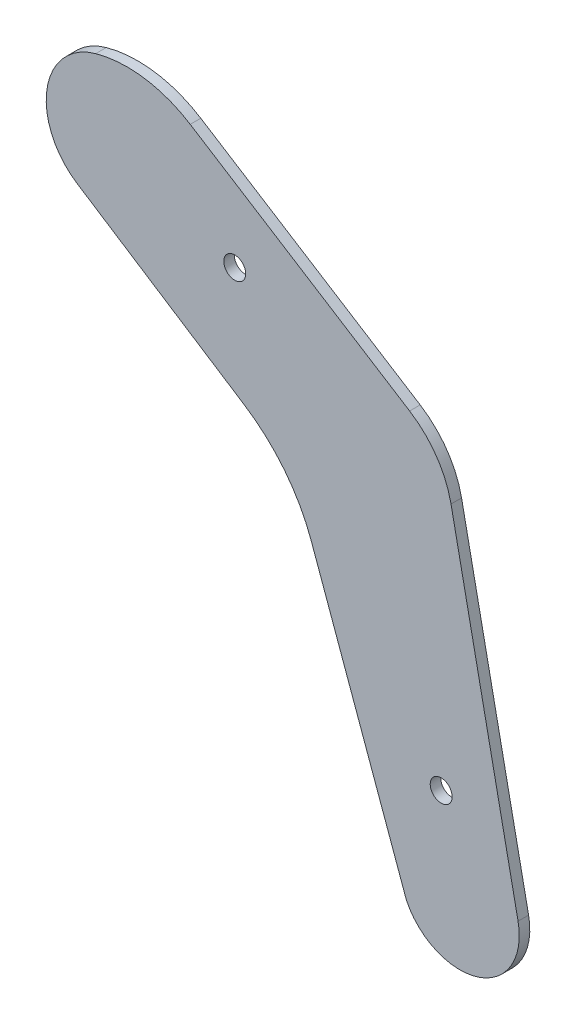
ISO-10303-21;
HEADER;
FILE_DESCRIPTION(('STEP AP214'),'2;1');
FILE_NAME('part.step','',(''),(''),'','','');
FILE_SCHEMA(('AUTOMOTIVE_DESIGN { 1 0 10303 214 1 1 1 1 }'));
ENDSEC;
DATA;
#1=APPLICATION_CONTEXT('core data for automotive mechanical design processes');
#2=APPLICATION_PROTOCOL_DEFINITION('international standard','automotive_design',2000,#1);
#3=PRODUCT_CONTEXT('',#1,'mechanical');
#4=PRODUCT('Part','Part','',(#3));
#5=PRODUCT_RELATED_PRODUCT_CATEGORY('part','',(#4));
#6=PRODUCT_DEFINITION_FORMATION('','',#4);
#7=PRODUCT_DEFINITION_CONTEXT('part definition',#1,'design');
#8=PRODUCT_DEFINITION('design','',#6,#7);
#9=PRODUCT_DEFINITION_SHAPE('','',#8);
#10=(LENGTH_UNIT() NAMED_UNIT(*) SI_UNIT(.MILLI.,.METRE.));
#11=(NAMED_UNIT(*) PLANE_ANGLE_UNIT() SI_UNIT($,.RADIAN.));
#12=(NAMED_UNIT(*) SI_UNIT($,.STERADIAN.) SOLID_ANGLE_UNIT());
#13=UNCERTAINTY_MEASURE_WITH_UNIT(LENGTH_MEASURE(1.E-05),#10,'distance_accuracy_value','');
#14=(GEOMETRIC_REPRESENTATION_CONTEXT(3) GLOBAL_UNCERTAINTY_ASSIGNED_CONTEXT((#13)) GLOBAL_UNIT_ASSIGNED_CONTEXT((#10,
#11,#12)) REPRESENTATION_CONTEXT('',''));
#15=CARTESIAN_POINT('',(0.,0.,0.));
#16=DIRECTION('',(0.,0.,1.));
#17=DIRECTION('',(1.,0.,0.));
#18=AXIS2_PLACEMENT_3D('',#15,#16,#17);
#19=CARTESIAN_POINT('',(-130.990896357706,174.574150066505,3.175));
#20=DIRECTION('',(0.533898973012235,0.845548275745673,0.));
#21=DIRECTION('',(-0.845548275745673,0.533898973012235,0.));
#22=AXIS2_PLACEMENT_3D('',#19,#20,#21);
#23=PLANE('',#22);
#24=DIRECTION('',(0.845548275745673,-0.533898973012235,0.));
#25=VECTOR('',#24,1.);
#26=CARTESIAN_POINT('',(-130.990896357706,174.574150066505,3.175));
#27=LINE('',#26,#25);
#28=CARTESIAN_POINT('',(-108.110462510506,160.126908574206,3.175));
#29=VERTEX_POINT('',#28);
#30=CARTESIAN_POINT('',(-42.05056185803,118.415141041425,3.175));
#31=VERTEX_POINT('',#30);
#32=EDGE_CURVE('E123',#29,#31,#27,.T.);
#33=ORIENTED_EDGE('',*,*,#32,.T.);
#34=DIRECTION('',(0.,0.,-1.));
#35=VECTOR('',#34,1.);
#36=CARTESIAN_POINT('',(-42.05056185803,118.415141041425,3.175));
#37=LINE('',#36,#35);
#38=CARTESIAN_POINT('',(-42.05056185803,118.415141041425,0.));
#39=VERTEX_POINT('',#38);
#40=EDGE_CURVE('E175',#31,#39,#37,.T.);
#41=ORIENTED_EDGE('',*,*,#40,.T.);
#42=DIRECTION('',(0.845548275745673,-0.533898973012235,0.));
#43=VECTOR('',#42,1.);
#44=CARTESIAN_POINT('',(-130.990896357706,174.574150066505,0.));
#45=LINE('',#44,#43);
#46=CARTESIAN_POINT('',(-108.110462510506,160.126908574206,0.));
#47=VERTEX_POINT('',#46);
#48=EDGE_CURVE('E147',#47,#39,#45,.T.);
#49=ORIENTED_EDGE('',*,*,#48,.F.);
#50=DIRECTION('',(0.,0.,-1.));
#51=VECTOR('',#50,1.);
#52=CARTESIAN_POINT('',(-108.110462510506,160.126908574206,3.175));
#53=LINE('',#52,#51);
#54=EDGE_CURVE('E169',#47,#29,#53,.F.);
#55=ORIENTED_EDGE('',*,*,#54,.T.);
#56=EDGE_LOOP('',(#33,#41,#49,#55));
#57=FACE_BOUND('',#56,.T.);
#58=ADVANCED_FACE('F39',(#57),#23,.T.);
#59=CARTESIAN_POINT('',(-77.4849538623172,85.8604140235499,3.175));
#60=DIRECTION('',(-0.542922711154153,-0.83978266814279,0.));
#61=DIRECTION('',(0.839782668142791,-0.542922711154153,0.));
#62=AXIS2_PLACEMENT_3D('',#59,#60,#61);
#63=PLANE('',#62);
#64=DIRECTION('',(-0.839782668142791,0.542922711154153,0.));
#65=VECTOR('',#64,1.);
#66=CARTESIAN_POINT('',(-77.4849538623172,85.8604140235499,3.175));
#67=LINE('',#66,#65);
#68=CARTESIAN_POINT('',(-91.8703690666621,95.1606400464251,3.175));
#69=VERTEX_POINT('',#68);
#70=CARTESIAN_POINT('',(-142.180328470816,127.686221478304,3.175));
#71=VERTEX_POINT('',#70);
#72=EDGE_CURVE('E132',#69,#71,#67,.T.);
#73=ORIENTED_EDGE('',*,*,#72,.T.);
#74=DIRECTION('',(0.,0.,-1.));
#75=VECTOR('',#74,1.);
#76=CARTESIAN_POINT('',(-142.180328470816,127.686221478303,3.175));
#77=LINE('',#76,#75);
#78=CARTESIAN_POINT('',(-142.180328470816,127.686221478304,0.));
#79=VERTEX_POINT('',#78);
#80=EDGE_CURVE('E200',#71,#79,#77,.T.);
#81=ORIENTED_EDGE('',*,*,#80,.T.);
#82=DIRECTION('',(-0.839782668142791,0.542922711154153,0.));
#83=VECTOR('',#82,1.);
#84=CARTESIAN_POINT('',(-77.4849538623172,85.8604140235499,0.));
#85=LINE('',#84,#83);
#86=CARTESIAN_POINT('',(-91.8703690666621,95.1606400464251,0.));
#87=VERTEX_POINT('',#86);
#88=EDGE_CURVE('E161',#87,#79,#85,.T.);
#89=ORIENTED_EDGE('',*,*,#88,.F.);
#90=DIRECTION('',(0.,0.,-1.));
#91=VECTOR('',#90,1.);
#92=CARTESIAN_POINT('',(-91.8703690666621,95.1606400464251,3.175));
#93=LINE('',#92,#91);
#94=EDGE_CURVE('E191',#87,#69,#93,.F.);
#95=ORIENTED_EDGE('',*,*,#94,.T.);
#96=EDGE_LOOP('',(#73,#81,#89,#95));
#97=FACE_BOUND('',#96,.T.);
#98=ADVANCED_FACE('F209',(#97),#63,.T.);
#99=CARTESIAN_POINT('',(-77.4849538623172,85.8604140235499,3.175));
#100=DIRECTION('',(-0.94059293929414,-0.339536334653612,0.));
#101=DIRECTION('',(0.339536334653612,-0.94059293929414,0.));
#102=AXIS2_PLACEMENT_3D('',#99,#100,#101);
#103=PLANE('',#102);
#104=DIRECTION('',(-0.339536334653612,0.94059293929414,0.));
#105=VECTOR('',#104,1.);
#106=CARTESIAN_POINT('',(-77.4849538623172,85.8604140235499,3.175));
#107=LINE('',#106,#105);
#108=CARTESIAN_POINT('',(-43.0106471295773,-9.64126338295301,3.175));
#109=VERTEX_POINT('',#108);
#110=CARTESIAN_POINT('',(-71.6687214771508,69.7481263051748,3.175));
#111=VERTEX_POINT('',#110);
#112=EDGE_CURVE('E137',#109,#111,#107,.T.);
#113=ORIENTED_EDGE('',*,*,#112,.T.);
#114=DIRECTION('',(0.,0.,-1.));
#115=VECTOR('',#114,1.);
#116=CARTESIAN_POINT('',(-71.6687214771508,69.7481263051748,0.));
#117=LINE('',#116,#115);
#118=CARTESIAN_POINT('',(-71.6687214771508,69.7481263051748,0.));
#119=VERTEX_POINT('',#118);
#120=EDGE_CURVE('E187',#111,#119,#117,.T.);
#121=ORIENTED_EDGE('',*,*,#120,.T.);
#122=DIRECTION('',(-0.339536334653612,0.94059293929414,0.));
#123=VECTOR('',#122,1.);
#124=CARTESIAN_POINT('',(-77.4849538623172,85.8604140235499,0.));
#125=LINE('',#124,#123);
#126=CARTESIAN_POINT('',(-43.0106471295773,-9.64126338295301,0.));
#127=VERTEX_POINT('',#126);
#128=EDGE_CURVE('E157',#127,#119,#125,.T.);
#129=ORIENTED_EDGE('',*,*,#128,.F.);
#130=DIRECTION('',(0.,0.,-1.));
#131=VECTOR('',#130,1.);
#132=CARTESIAN_POINT('',(-43.0106471295773,-9.64126338295301,3.175));
#133=LINE('',#132,#131);
#134=EDGE_CURVE('E131',#109,#127,#133,.T.);
#135=ORIENTED_EDGE('',*,*,#134,.F.);
#136=EDGE_LOOP('',(#113,#121,#129,#135));
#137=FACE_BOUND('',#136,.T.);
#138=ADVANCED_FACE('F221',(#137),#103,.T.);
#139=CARTESIAN_POINT('',(-26.9175004372317,-1.87101839819861,3.175));
#140=DIRECTION('',(0.,0.,-1.));
#141=DIRECTION('',(-1.,0.,0.));
#142=AXIS2_PLACEMENT_3D('',#139,#140,#141);
#143=CYLINDRICAL_SURFACE('',#142,17.8708163659206);
#144=CARTESIAN_POINT('',(-26.9175004372317,-1.87101839819861,0.));
#145=DIRECTION('',(0.,0.,-1.));
#146=DIRECTION('',(-1.,0.,0.));
#147=AXIS2_PLACEMENT_3D('',#144,#145,#146);
#148=CIRCLE('',#147,17.8708163659206);
#149=CARTESIAN_POINT('',(-9.40922451134796,1.71037123259765,0.));
#150=VERTEX_POINT('',#149);
#151=EDGE_CURVE('E129',#150,#127,#148,.T.);
#152=ORIENTED_EDGE('',*,*,#151,.F.);
#153=DIRECTION('',(0.,0.,-1.));
#154=VECTOR('',#153,1.);
#155=CARTESIAN_POINT('',(-9.40922451134796,1.71037123259765,3.175));
#156=LINE('',#155,#154);
#157=CARTESIAN_POINT('',(-9.40922451134796,1.71037123259765,3.175));
#158=VERTEX_POINT('',#157);
#159=EDGE_CURVE('E114',#158,#150,#156,.T.);
#160=ORIENTED_EDGE('',*,*,#159,.F.);
#161=CARTESIAN_POINT('',(-26.9175004372317,-1.87101839819861,3.175));
#162=DIRECTION('',(0.,0.,-1.));
#163=DIRECTION('',(-1.,0.,0.));
#164=AXIS2_PLACEMENT_3D('',#161,#162,#163);
#165=CIRCLE('',#164,17.8708163659206);
#166=EDGE_CURVE('E122',#158,#109,#165,.T.);
#167=ORIENTED_EDGE('',*,*,#166,.T.);
#168=ORIENTED_EDGE('',*,*,#134,.T.);
#169=EDGE_LOOP('',(#152,#160,#167,#168));
#170=FACE_BOUND('',#169,.T.);
#171=ADVANCED_FACE('F127',(#170),#143,.T.);
#172=CARTESIAN_POINT('',(-31.981087973147,112.057039534836,3.175));
#173=DIRECTION('',(0.979713269242237,0.200404366396262,0.));
#174=DIRECTION('',(-0.200404366396262,0.979713269242238,0.));
#175=AXIS2_PLACEMENT_3D('',#172,#173,#174);
#176=PLANE('',#175);
#177=DIRECTION('',(0.200404366396262,-0.979713269242237,0.));
#178=VECTOR('',#177,1.);
#179=CARTESIAN_POINT('',(-31.981087973147,112.057039534836,0.));
#180=LINE('',#179,#178);
#181=CARTESIAN_POINT('',(-29.5945104213638,100.389820214203,0.));
#182=VERTEX_POINT('',#181);
#183=EDGE_CURVE('E151',#182,#150,#180,.T.);
#184=ORIENTED_EDGE('',*,*,#183,.F.);
#185=DIRECTION('',(0.,0.,-1.));
#186=VECTOR('',#185,1.);
#187=CARTESIAN_POINT('',(-29.5945104213638,100.389820214203,3.175));
#188=LINE('',#187,#186);
#189=CARTESIAN_POINT('',(-29.5945104213638,100.389820214203,3.175));
#190=VERTEX_POINT('',#189);
#191=EDGE_CURVE('E117',#182,#190,#188,.F.);
#192=ORIENTED_EDGE('',*,*,#191,.T.);
#193=DIRECTION('',(0.200404366396262,-0.979713269242237,0.));
#194=VECTOR('',#193,1.);
#195=CARTESIAN_POINT('',(-31.981087973147,112.057039534836,3.175));
#196=LINE('',#195,#194);
#197=EDGE_CURVE('E110',#190,#158,#196,.T.);
#198=ORIENTED_EDGE('',*,*,#197,.T.);
#199=ORIENTED_EDGE('',*,*,#159,.T.);
#200=EDGE_LOOP('',(#184,#192,#198,#199));
#201=FACE_BOUND('',#200,.T.);
#202=ADVANCED_FACE('F113',(#201),#176,.T.);
#203=CARTESIAN_POINT('',(-26.9175004372317,-1.87101839819861,3.175));
#204=DIRECTION('',(0.,0.,-1.));
#205=DIRECTION('',(-1.,0.,0.));
#206=AXIS2_PLACEMENT_3D('',#203,#204,#205);
#207=PLANE('',#206);
#208=CARTESIAN_POINT('',(-94.7070787641731,129.476886964954,3.175));
#209=DIRECTION('',(0.,0.,-1.));
#210=DIRECTION('',(-1.,0.,0.));
#211=AXIS2_PLACEMENT_3D('',#208,#209,#210);
#212=CIRCLE('',#211,3.302);
#213=CARTESIAN_POINT('',(-98.0090787641731,129.476886964954,3.175));
#214=VERTEX_POINT('',#213);
#215=EDGE_CURVE('E236',#214,#214,#212,.T.);
#216=ORIENTED_EDGE('',*,*,#215,.T.);
#217=EDGE_LOOP('',(#216));
#218=FACE_BOUND('',#217,.T.);
#219=CARTESIAN_POINT('',(-32.5540017937413,24.2133734622882,3.175));
#220=DIRECTION('',(0.,0.,-1.));
#221=DIRECTION('',(-1.,0.,0.));
#222=AXIS2_PLACEMENT_3D('',#219,#220,#221);
#223=CIRCLE('',#222,3.302);
#224=CARTESIAN_POINT('',(-35.8560017937413,24.2133734622882,3.175));
#225=VERTEX_POINT('',#224);
#226=EDGE_CURVE('E152',#225,#225,#223,.T.);
#227=ORIENTED_EDGE('',*,*,#226,.T.);
#228=EDGE_LOOP('',(#227));
#229=FACE_BOUND('',#228,.T.);
#230=CARTESIAN_POINT('',(-127.095909990821,130.05921188869,3.175));
#231=DIRECTION('',(0.,0.,-1.));
#232=DIRECTION('',(-1.,0.,0.));
#233=AXIS2_PLACEMENT_3D('',#230,#231,#232);
#234=CIRCLE('',#233,35.56);
#235=CARTESIAN_POINT('',(-136.551110965953,164.339129836665,3.175));
#236=VERTEX_POINT('',#235);
#237=EDGE_CURVE('E172',#29,#236,#234,.F.);
#238=ORIENTED_EDGE('',*,*,#237,.T.);
#239=CARTESIAN_POINT('',(-131.148138980163,144.750605294965,3.175));
#240=DIRECTION('',(0.,0.,-1.));
#241=DIRECTION('',(-1.,0.,0.));
#242=AXIS2_PLACEMENT_3D('',#239,#240,#241);
#243=CIRCLE('',#242,20.32);
#244=EDGE_CURVE('E11',#236,#71,#243,.F.);
#245=ORIENTED_EDGE('',*,*,#244,.T.);
#246=ORIENTED_EDGE('',*,*,#72,.F.);
#247=CARTESIAN_POINT('',(-119.450842793293,52.4996805047713,3.175));
#248=DIRECTION('',(0.,0.,-1.));
#249=DIRECTION('',(-1.,0.,0.));
#250=AXIS2_PLACEMENT_3D('',#247,#248,#249);
#251=CIRCLE('',#250,50.8);
#252=EDGE_CURVE('E197',#69,#111,#251,.T.);
#253=ORIENTED_EDGE('',*,*,#252,.T.);
#254=ORIENTED_EDGE('',*,*,#112,.F.);
#255=ORIENTED_EDGE('',*,*,#166,.F.);
#256=ORIENTED_EDGE('',*,*,#197,.F.);
#257=CARTESIAN_POINT('',(-56.9676991639919,94.7905222170911,3.175));
#258=DIRECTION('',(0.,0.,-1.));
#259=DIRECTION('',(-1.,0.,0.));
#260=AXIS2_PLACEMENT_3D('',#257,#258,#259);
#261=CIRCLE('',#260,27.94);
#262=EDGE_CURVE('E184',#190,#31,#261,.F.);
#263=ORIENTED_EDGE('',*,*,#262,.T.);
#264=ORIENTED_EDGE('',*,*,#32,.F.);
#265=EDGE_LOOP('',(#238,#245,#246,#253,#254,#255,#256,#263,#264));
#266=FACE_BOUND('',#265,.T.);
#267=ADVANCED_FACE('F135',(#218,#229,#266),#207,.F.);
#268=CARTESIAN_POINT('',(-26.9175004372317,-1.87101839819861,0.));
#269=DIRECTION('',(0.,0.,-1.));
#270=DIRECTION('',(-1.,0.,0.));
#271=AXIS2_PLACEMENT_3D('',#268,#269,#270);
#272=PLANE('',#271);
#273=CARTESIAN_POINT('',(-94.7070787641731,129.476886964954,0.));
#274=DIRECTION('',(0.,0.,-1.));
#275=DIRECTION('',(-1.,0.,0.));
#276=AXIS2_PLACEMENT_3D('',#273,#274,#275);
#277=CIRCLE('',#276,3.302);
#278=CARTESIAN_POINT('',(-98.0090787641731,129.476886964954,0.));
#279=VERTEX_POINT('',#278);
#280=EDGE_CURVE('E240',#279,#279,#277,.T.);
#281=ORIENTED_EDGE('',*,*,#280,.F.);
#282=EDGE_LOOP('',(#281));
#283=FACE_BOUND('',#282,.T.);
#284=CARTESIAN_POINT('',(-32.5540017937413,24.2133734622882,0.));
#285=DIRECTION('',(0.,0.,-1.));
#286=DIRECTION('',(-1.,0.,0.));
#287=AXIS2_PLACEMENT_3D('',#284,#285,#286);
#288=CIRCLE('',#287,3.302);
#289=CARTESIAN_POINT('',(-35.8560017937413,24.2133734622882,0.));
#290=VERTEX_POINT('',#289);
#291=EDGE_CURVE('E232',#290,#290,#288,.T.);
#292=ORIENTED_EDGE('',*,*,#291,.F.);
#293=EDGE_LOOP('',(#292));
#294=FACE_BOUND('',#293,.T.);
#295=ORIENTED_EDGE('',*,*,#88,.T.);
#296=CARTESIAN_POINT('',(-131.148138980163,144.750605294965,0.));
#297=DIRECTION('',(0.,0.,-1.));
#298=DIRECTION('',(-1.,0.,0.));
#299=AXIS2_PLACEMENT_3D('',#296,#297,#298);
#300=CIRCLE('',#299,20.32);
#301=CARTESIAN_POINT('',(-136.551110965953,164.339129836665,0.));
#302=VERTEX_POINT('',#301);
#303=EDGE_CURVE('E62',#79,#302,#300,.T.);
#304=ORIENTED_EDGE('',*,*,#303,.T.);
#305=CARTESIAN_POINT('',(-127.095909990821,130.05921188869,0.));
#306=DIRECTION('',(0.,0.,-1.));
#307=DIRECTION('',(-1.,0.,0.));
#308=AXIS2_PLACEMENT_3D('',#305,#306,#307);
#309=CIRCLE('',#308,35.56);
#310=EDGE_CURVE('E165',#302,#47,#309,.T.);
#311=ORIENTED_EDGE('',*,*,#310,.T.);
#312=ORIENTED_EDGE('',*,*,#48,.T.);
#313=CARTESIAN_POINT('',(-56.9676991639919,94.7905222170911,0.));
#314=DIRECTION('',(0.,0.,-1.));
#315=DIRECTION('',(-1.,0.,0.));
#316=AXIS2_PLACEMENT_3D('',#313,#314,#315);
#317=CIRCLE('',#316,27.94);
#318=EDGE_CURVE('E179',#39,#182,#317,.T.);
#319=ORIENTED_EDGE('',*,*,#318,.T.);
#320=ORIENTED_EDGE('',*,*,#183,.T.);
#321=ORIENTED_EDGE('',*,*,#151,.T.);
#322=ORIENTED_EDGE('',*,*,#128,.T.);
#323=CARTESIAN_POINT('',(-119.450842793293,52.4996805047713,0.));
#324=DIRECTION('',(0.,0.,-1.));
#325=DIRECTION('',(-1.,0.,0.));
#326=AXIS2_PLACEMENT_3D('',#323,#324,#325);
#327=CIRCLE('',#326,50.8);
#328=EDGE_CURVE('E194',#119,#87,#327,.F.);
#329=ORIENTED_EDGE('',*,*,#328,.T.);
#330=EDGE_LOOP('',(#295,#304,#311,#312,#319,#320,#321,#322,#329));
#331=FACE_BOUND('',#330,.T.);
#332=ADVANCED_FACE('F214',(#283,#294,#331),#272,.T.);
#333=CARTESIAN_POINT('',(-32.5540017937413,24.2133734622882,3.175));
#334=DIRECTION('',(0.,0.,-1.));
#335=DIRECTION('',(-1.,0.,0.));
#336=AXIS2_PLACEMENT_3D('',#333,#334,#335);
#337=CYLINDRICAL_SURFACE('',#336,3.302);
#338=ORIENTED_EDGE('',*,*,#226,.F.);
#339=EDGE_LOOP('',(#338));
#340=FACE_BOUND('',#339,.T.);
#341=ORIENTED_EDGE('',*,*,#291,.T.);
#342=EDGE_LOOP('',(#341));
#343=FACE_BOUND('',#342,.T.);
#344=ADVANCED_FACE('F254',(#340,#343),#337,.F.);
#345=CARTESIAN_POINT('',(-94.7070787641731,129.476886964954,3.175));
#346=DIRECTION('',(0.,0.,-1.));
#347=DIRECTION('',(-1.,0.,0.));
#348=AXIS2_PLACEMENT_3D('',#345,#346,#347);
#349=CYLINDRICAL_SURFACE('',#348,3.302);
#350=ORIENTED_EDGE('',*,*,#215,.F.);
#351=EDGE_LOOP('',(#350));
#352=FACE_BOUND('',#351,.T.);
#353=ORIENTED_EDGE('',*,*,#280,.T.);
#354=EDGE_LOOP('',(#353));
#355=FACE_BOUND('',#354,.T.);
#356=ADVANCED_FACE('F250',(#352,#355),#349,.F.);
#357=CARTESIAN_POINT('',(-127.095909990821,130.05921188869,3.175));
#358=DIRECTION('',(0.,0.,-1.));
#359=DIRECTION('',(-1.,0.,0.));
#360=AXIS2_PLACEMENT_3D('',#357,#358,#359);
#361=CYLINDRICAL_SURFACE('',#360,35.56);
#362=ORIENTED_EDGE('',*,*,#310,.F.);
#363=DIRECTION('',(0.,0.,-1.));
#364=VECTOR('',#363,1.);
#365=CARTESIAN_POINT('',(-136.551110965953,164.339129836665,3.175));
#366=LINE('',#365,#364);
#367=EDGE_CURVE('E48',#302,#236,#366,.F.);
#368=ORIENTED_EDGE('',*,*,#367,.T.);
#369=ORIENTED_EDGE('',*,*,#237,.F.);
#370=ORIENTED_EDGE('',*,*,#54,.F.);
#371=EDGE_LOOP('',(#362,#368,#369,#370));
#372=FACE_BOUND('',#371,.T.);
#373=ADVANCED_FACE('F253',(#372),#361,.T.);
#374=CARTESIAN_POINT('',(-56.9676991639919,94.7905222170911,3.175));
#375=DIRECTION('',(0.,0.,-1.));
#376=DIRECTION('',(-1.,0.,0.));
#377=AXIS2_PLACEMENT_3D('',#374,#375,#376);
#378=CYLINDRICAL_SURFACE('',#377,27.94);
#379=ORIENTED_EDGE('',*,*,#262,.F.);
#380=ORIENTED_EDGE('',*,*,#191,.F.);
#381=ORIENTED_EDGE('',*,*,#318,.F.);
#382=ORIENTED_EDGE('',*,*,#40,.F.);
#383=EDGE_LOOP('',(#379,#380,#381,#382));
#384=FACE_BOUND('',#383,.T.);
#385=ADVANCED_FACE('F223',(#384),#378,.T.);
#386=CARTESIAN_POINT('',(-119.450842793293,52.4996805047713,3.175));
#387=DIRECTION('',(0.,0.,1.));
#388=DIRECTION('',(1.,0.,0.));
#389=AXIS2_PLACEMENT_3D('',#386,#387,#388);
#390=CYLINDRICAL_SURFACE('',#389,50.8);
#391=ORIENTED_EDGE('',*,*,#252,.F.);
#392=ORIENTED_EDGE('',*,*,#94,.F.);
#393=ORIENTED_EDGE('',*,*,#328,.F.);
#394=ORIENTED_EDGE('',*,*,#120,.F.);
#395=EDGE_LOOP('',(#391,#392,#393,#394));
#396=FACE_BOUND('',#395,.T.);
#397=ADVANCED_FACE('F219',(#396),#390,.F.);
#398=CARTESIAN_POINT('',(-131.148138980163,144.750605294965,3.175));
#399=DIRECTION('',(0.,0.,-1.));
#400=DIRECTION('',(-1.,0.,0.));
#401=AXIS2_PLACEMENT_3D('',#398,#399,#400);
#402=CYLINDRICAL_SURFACE('',#401,20.32);
#403=ORIENTED_EDGE('',*,*,#244,.F.);
#404=ORIENTED_EDGE('',*,*,#367,.F.);
#405=ORIENTED_EDGE('',*,*,#303,.F.);
#406=ORIENTED_EDGE('',*,*,#80,.F.);
#407=EDGE_LOOP('',(#403,#404,#405,#406));
#408=FACE_BOUND('',#407,.T.);
#409=ADVANCED_FACE('F41',(#408),#402,.T.);
#410=CLOSED_SHELL('',(#58,#98,#138,#171,#202,#267,#332,#344,#356,#373,#385,#397,#409));
#411=MANIFOLD_SOLID_BREP('B2',#410);
#412=ADVANCED_BREP_SHAPE_REPRESENTATION('',(#18,#411),#14);
#413=SHAPE_DEFINITION_REPRESENTATION(#9,#412);
ENDSEC;
END-ISO-10303-21;
